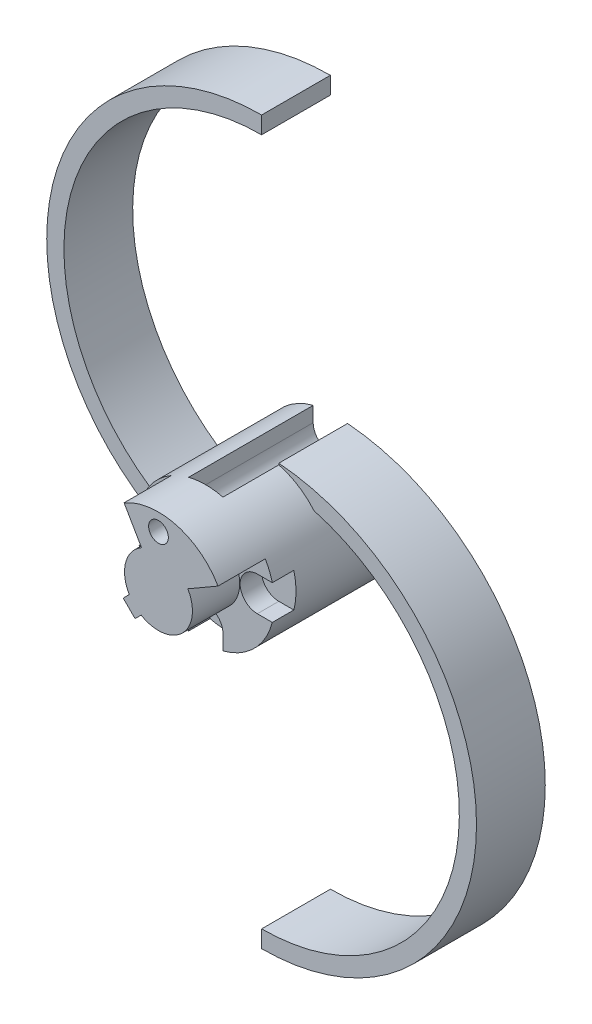
ISO-10303-21;
HEADER;
FILE_DESCRIPTION(('STEP AP214'),'2;1');
FILE_NAME('part.step','',(''),(''),'','','');
FILE_SCHEMA(('AUTOMOTIVE_DESIGN { 1 0 10303 214 1 1 1 1 }'));
ENDSEC;
DATA;
#1=APPLICATION_CONTEXT('core data for automotive mechanical design processes');
#2=APPLICATION_PROTOCOL_DEFINITION('international standard','automotive_design',2000,#1);
#3=PRODUCT_CONTEXT('',#1,'mechanical');
#4=PRODUCT('Part','Part','',(#3));
#5=PRODUCT_RELATED_PRODUCT_CATEGORY('part','',(#4));
#6=PRODUCT_DEFINITION_FORMATION('','',#4);
#7=PRODUCT_DEFINITION_CONTEXT('part definition',#1,'design');
#8=PRODUCT_DEFINITION('design','',#6,#7);
#9=PRODUCT_DEFINITION_SHAPE('','',#8);
#10=(LENGTH_UNIT() NAMED_UNIT(*) SI_UNIT(.MILLI.,.METRE.));
#11=(NAMED_UNIT(*) PLANE_ANGLE_UNIT() SI_UNIT($,.RADIAN.));
#12=(NAMED_UNIT(*) SI_UNIT($,.STERADIAN.) SOLID_ANGLE_UNIT());
#13=UNCERTAINTY_MEASURE_WITH_UNIT(LENGTH_MEASURE(1.E-05),#10,'distance_accuracy_value','');
#14=(GEOMETRIC_REPRESENTATION_CONTEXT(3) GLOBAL_UNCERTAINTY_ASSIGNED_CONTEXT((#13)) GLOBAL_UNIT_ASSIGNED_CONTEXT((#10,
#11,#12)) REPRESENTATION_CONTEXT('',''));
#15=CARTESIAN_POINT('',(0.,0.,0.));
#16=DIRECTION('',(0.,0.,1.));
#17=DIRECTION('',(1.,0.,0.));
#18=AXIS2_PLACEMENT_3D('',#15,#16,#17);
#19=CARTESIAN_POINT('',(-2.,-8.,17.6568542494924));
#20=DIRECTION('',(-1.,0.,0.));
#21=DIRECTION('',(0.,-1.,0.));
#22=AXIS2_PLACEMENT_3D('',#19,#20,#21);
#23=PLANE('',#22);
#24=DIRECTION('',(0.,0.,-1.));
#25=VECTOR('',#24,1.);
#26=CARTESIAN_POINT('',(-2.,-6.,17.6568542494924));
#27=LINE('',#26,#25);
#28=CARTESIAN_POINT('',(-2.,-6.,6.5));
#29=VERTEX_POINT('',#28);
#30=CARTESIAN_POINT('',(-2.,-6.,4.));
#31=VERTEX_POINT('',#30);
#32=EDGE_CURVE('E339',#29,#31,#27,.T.);
#33=ORIENTED_EDGE('',*,*,#32,.F.);
#34=DIRECTION('',(0.,-1.,0.));
#35=VECTOR('',#34,1.);
#36=CARTESIAN_POINT('',(-2.,-8.,6.5));
#37=LINE('',#36,#35);
#38=CARTESIAN_POINT('',(-2.,-7.74596669241483,6.5));
#39=VERTEX_POINT('',#38);
#40=EDGE_CURVE('E352',#29,#39,#37,.T.);
#41=ORIENTED_EDGE('',*,*,#40,.T.);
#42=DIRECTION('',(0.,0.,1.));
#43=VECTOR('',#42,1.);
#44=CARTESIAN_POINT('',(-2.,-7.74596669241483,-8.));
#45=LINE('',#44,#43);
#46=CARTESIAN_POINT('',(-2.,-7.74596669241483,4.));
#47=VERTEX_POINT('',#46);
#48=EDGE_CURVE('E466',#39,#47,#45,.F.);
#49=ORIENTED_EDGE('',*,*,#48,.T.);
#50=DIRECTION('',(0.,-1.,0.));
#51=VECTOR('',#50,1.);
#52=CARTESIAN_POINT('',(-2.,-8.,4.));
#53=LINE('',#52,#51);
#54=EDGE_CURVE('E837',#31,#47,#53,.T.);
#55=ORIENTED_EDGE('',*,*,#54,.F.);
#56=EDGE_LOOP('',(#33,#41,#49,#55));
#57=FACE_BOUND('',#56,.T.);
#58=ADVANCED_FACE('F35',(#57),#23,.F.);
#59=CARTESIAN_POINT('',(0.,0.,-8.));
#60=DIRECTION('',(0.,0.,1.));
#61=DIRECTION('',(-1.,0.,0.));
#62=AXIS2_PLACEMENT_3D('',#59,#60,#61);
#63=CYLINDRICAL_SURFACE('',#62,8.);
#64=CARTESIAN_POINT('',(0.,0.,4.));
#65=DIRECTION('',(0.,0.,-1.));
#66=DIRECTION('',(-1.,0.,0.));
#67=AXIS2_PLACEMENT_3D('',#64,#65,#66);
#68=CIRCLE('',#67,8.00000000000001);
#69=CARTESIAN_POINT('',(7.74596669241483,-2.,4.));
#70=VERTEX_POINT('',#69);
#71=CARTESIAN_POINT('',(7.74596669241483,2.,4.));
#72=VERTEX_POINT('',#71);
#73=EDGE_CURVE('E853',#70,#72,#68,.F.);
#74=ORIENTED_EDGE('',*,*,#73,.F.);
#75=DIRECTION('',(0.,0.,1.));
#76=VECTOR('',#75,1.);
#77=CARTESIAN_POINT('',(7.74596669241483,-2.,-8.));
#78=LINE('',#77,#76);
#79=CARTESIAN_POINT('',(7.74596669241483,-2.,6.5));
#80=VERTEX_POINT('',#79);
#81=EDGE_CURVE('E461',#80,#70,#78,.F.);
#82=ORIENTED_EDGE('',*,*,#81,.F.);
#83=CARTESIAN_POINT('',(0.,0.,6.5));
#84=DIRECTION('',(0.,0.,-1.));
#85=DIRECTION('',(-1.,0.,0.));
#86=AXIS2_PLACEMENT_3D('',#83,#84,#85);
#87=CIRCLE('',#86,8.);
#88=CARTESIAN_POINT('',(2.,-7.74596669241483,6.5));
#89=VERTEX_POINT('',#88);
#90=EDGE_CURVE('E886',#89,#80,#87,.F.);
#91=ORIENTED_EDGE('',*,*,#90,.F.);
#92=DIRECTION('',(0.,0.,1.));
#93=VECTOR('',#92,1.);
#94=CARTESIAN_POINT('',(2.,-7.74596669241483,-8.));
#95=LINE('',#94,#93);
#96=CARTESIAN_POINT('',(2.,-7.74596669241483,4.));
#97=VERTEX_POINT('',#96);
#98=EDGE_CURVE('E463',#97,#89,#95,.T.);
#99=ORIENTED_EDGE('',*,*,#98,.F.);
#100=EDGE_CURVE('E839',#47,#97,#68,.F.);
#101=ORIENTED_EDGE('',*,*,#100,.F.);
#102=ORIENTED_EDGE('',*,*,#48,.F.);
#103=CARTESIAN_POINT('',(-7.74596669241483,-2.,6.5));
#104=VERTEX_POINT('',#103);
#105=EDGE_CURVE('E850',#104,#39,#87,.F.);
#106=ORIENTED_EDGE('',*,*,#105,.F.);
#107=DIRECTION('',(0.,0.,1.));
#108=VECTOR('',#107,1.);
#109=CARTESIAN_POINT('',(-7.74596669241483,-2.,-8.));
#110=LINE('',#109,#108);
#111=CARTESIAN_POINT('',(-7.74596669241483,-2.,4.));
#112=VERTEX_POINT('',#111);
#113=EDGE_CURVE('E469',#112,#104,#110,.T.);
#114=ORIENTED_EDGE('',*,*,#113,.F.);
#115=CARTESIAN_POINT('',(-7.74596669241483,2.,4.));
#116=VERTEX_POINT('',#115);
#117=EDGE_CURVE('E852',#116,#112,#68,.F.);
#118=ORIENTED_EDGE('',*,*,#117,.F.);
#119=DIRECTION('',(0.,0.,1.));
#120=VECTOR('',#119,1.);
#121=CARTESIAN_POINT('',(-7.74596669241483,2.,-8.));
#122=LINE('',#121,#120);
#123=CARTESIAN_POINT('',(-7.74596669241483,2.,6.5));
#124=VERTEX_POINT('',#123);
#125=EDGE_CURVE('E472',#124,#116,#122,.F.);
#126=ORIENTED_EDGE('',*,*,#125,.F.);
#127=CARTESIAN_POINT('',(-4.00000000000001,6.92820323027551,6.5));
#128=VERTEX_POINT('',#127);
#129=EDGE_CURVE('E867',#128,#124,#87,.F.);
#130=ORIENTED_EDGE('',*,*,#129,.F.);
#131=DIRECTION('',(0.,0.,1.));
#132=VECTOR('',#131,1.);
#133=CARTESIAN_POINT('',(-4.00000000000001,6.92820323027551,-15.3826701223687));
#134=LINE('',#133,#132);
#135=CARTESIAN_POINT('',(-4.00000000000001,6.92820323027551,12.));
#136=VERTEX_POINT('',#135);
#137=EDGE_CURVE('E307',#128,#136,#134,.T.);
#138=ORIENTED_EDGE('',*,*,#137,.T.);
#139=CARTESIAN_POINT('',(0.,0.,12.));
#140=DIRECTION('',(0.,0.,-1.));
#141=DIRECTION('',(-1.,0.,0.));
#142=AXIS2_PLACEMENT_3D('',#139,#140,#141);
#143=CIRCLE('',#142,8.);
#144=CARTESIAN_POINT('',(6.92820323027549,4.00000000000003,12.));
#145=VERTEX_POINT('',#144);
#146=EDGE_CURVE('E394',#136,#145,#143,.T.);
#147=ORIENTED_EDGE('',*,*,#146,.T.);
#148=DIRECTION('',(0.,0.,1.));
#149=VECTOR('',#148,1.);
#150=CARTESIAN_POINT('',(6.92820323027549,4.00000000000003,-15.3826701223687));
#151=LINE('',#150,#149);
#152=CARTESIAN_POINT('',(6.92820323027549,4.00000000000003,6.5));
#153=VERTEX_POINT('',#152);
#154=EDGE_CURVE('E262',#153,#145,#151,.T.);
#155=ORIENTED_EDGE('',*,*,#154,.F.);
#156=CARTESIAN_POINT('',(7.74596669241483,2.,6.5));
#157=VERTEX_POINT('',#156);
#158=EDGE_CURVE('E298',#157,#153,#87,.F.);
#159=ORIENTED_EDGE('',*,*,#158,.F.);
#160=DIRECTION('',(0.,0.,1.));
#161=VECTOR('',#160,1.);
#162=CARTESIAN_POINT('',(7.74596669241483,2.,-8.));
#163=LINE('',#162,#161);
#164=EDGE_CURVE('E459',#72,#157,#163,.T.);
#165=ORIENTED_EDGE('',*,*,#164,.F.);
#166=EDGE_LOOP('',(#74,#82,#91,#99,#101,#102,#106,#114,#118,#126,#130,#138,#147,#155,#159,#165));
#167=FACE_BOUND('',#166,.T.);
#168=CARTESIAN_POINT('',(0.,0.,0.));
#169=DIRECTION('',(0.,0.,-1.));
#170=DIRECTION('',(-1.,0.,0.));
#171=AXIS2_PLACEMENT_3D('',#168,#169,#170);
#172=CIRCLE('',#171,8.);
#173=CARTESIAN_POINT('',(2.,7.74596669241483,0.));
#174=VERTEX_POINT('',#173);
#175=CARTESIAN_POINT('',(6.09952065732504,5.17647058823529,0.));
#176=VERTEX_POINT('',#175);
#177=EDGE_CURVE('E393',#174,#176,#172,.T.);
#178=ORIENTED_EDGE('',*,*,#177,.F.);
#179=DIRECTION('',(0.,0.,1.));
#180=VECTOR('',#179,1.);
#181=CARTESIAN_POINT('',(2.,7.74596669241483,-8.));
#182=LINE('',#181,#180);
#183=CARTESIAN_POINT('',(2.,7.74596669241483,6.5));
#184=VERTEX_POINT('',#183);
#185=EDGE_CURVE('E382',#184,#174,#182,.F.);
#186=ORIENTED_EDGE('',*,*,#185,.F.);
#187=CARTESIAN_POINT('',(0.,0.,6.5));
#188=DIRECTION('',(0.,0.,-1.));
#189=DIRECTION('',(-1.,0.,0.));
#190=AXIS2_PLACEMENT_3D('',#187,#188,#189);
#191=CIRCLE('',#190,8.);
#192=CARTESIAN_POINT('',(-2.,7.74596669241483,6.5));
#193=VERTEX_POINT('',#192);
#194=EDGE_CURVE('E376',#193,#184,#191,.T.);
#195=ORIENTED_EDGE('',*,*,#194,.F.);
#196=DIRECTION('',(0.,0.,1.));
#197=VECTOR('',#196,1.);
#198=CARTESIAN_POINT('',(-2.,7.74596669241483,-8.));
#199=LINE('',#198,#197);
#200=CARTESIAN_POINT('',(-2.,7.74596669241483,-8.));
#201=VERTEX_POINT('',#200);
#202=EDGE_CURVE('E43',#201,#193,#199,.T.);
#203=ORIENTED_EDGE('',*,*,#202,.F.);
#204=CARTESIAN_POINT('',(0.,0.,-8.));
#205=DIRECTION('',(0.,0.,1.));
#206=DIRECTION('',(1.,0.,0.));
#207=AXIS2_PLACEMENT_3D('',#204,#205,#206);
#208=CIRCLE('',#207,8.);
#209=CARTESIAN_POINT('',(-6.09952065732504,-5.17647058823529,-8.));
#210=VERTEX_POINT('',#209);
#211=EDGE_CURVE('E400',#201,#210,#208,.T.);
#212=ORIENTED_EDGE('',*,*,#211,.T.);
#213=DIRECTION('',(0.,0.,1.));
#214=VECTOR('',#213,1.);
#215=CARTESIAN_POINT('',(-6.09952065732504,-5.17647058823529,-8.));
#216=LINE('',#215,#214);
#217=CARTESIAN_POINT('',(-6.09952065732504,-5.17647058823529,0.));
#218=VERTEX_POINT('',#217);
#219=EDGE_CURVE('E452',#210,#218,#216,.T.);
#220=ORIENTED_EDGE('',*,*,#219,.T.);
#221=CARTESIAN_POINT('',(-2.,-7.74596669241483,0.));
#222=VERTEX_POINT('',#221);
#223=EDGE_CURVE('E399',#222,#218,#172,.T.);
#224=ORIENTED_EDGE('',*,*,#223,.F.);
#225=DIRECTION('',(0.,0.,-1.));
#226=VECTOR('',#225,1.);
#227=CARTESIAN_POINT('',(-2.,-7.74596669241485,27.5359137665061));
#228=LINE('',#227,#226);
#229=CARTESIAN_POINT('',(-2.,-7.74596669241485,-8.));
#230=VERTEX_POINT('',#229);
#231=EDGE_CURVE('E279',#222,#230,#228,.T.);
#232=ORIENTED_EDGE('',*,*,#231,.T.);
#233=CARTESIAN_POINT('',(0.,0.,-8.));
#234=DIRECTION('',(0.,0.,1.));
#235=DIRECTION('',(1.,0.,0.));
#236=AXIS2_PLACEMENT_3D('',#233,#234,#235);
#237=CIRCLE('',#236,8.);
#238=CARTESIAN_POINT('',(6.09952065732504,5.17647058823529,-8.));
#239=VERTEX_POINT('',#238);
#240=EDGE_CURVE('E413',#230,#239,#237,.T.);
#241=ORIENTED_EDGE('',*,*,#240,.T.);
#242=DIRECTION('',(0.,0.,1.));
#243=VECTOR('',#242,1.);
#244=CARTESIAN_POINT('',(6.09952065732504,5.17647058823529,-8.));
#245=LINE('',#244,#243);
#246=EDGE_CURVE('E445',#239,#176,#245,.T.);
#247=ORIENTED_EDGE('',*,*,#246,.T.);
#248=EDGE_LOOP('',(#178,#186,#195,#203,#212,#220,#224,#232,#241,#247));
#249=FACE_BOUND('',#248,.T.);
#250=ADVANCED_FACE('F483',(#167,#249),#63,.T.);
#251=CARTESIAN_POINT('',(0.,0.,0.));
#252=DIRECTION('',(0.,0.,-1.));
#253=DIRECTION('',(1.,0.,0.));
#254=AXIS2_PLACEMENT_3D('',#251,#252,#253);
#255=PLANE('',#254);
#256=ORIENTED_EDGE('',*,*,#177,.T.);
#257=CARTESIAN_POINT('',(0.,-17.,0.));
#258=DIRECTION('',(0.,0.,-1.));
#259=DIRECTION('',(-1.,0.,0.));
#260=AXIS2_PLACEMENT_3D('',#257,#258,#259);
#261=CIRCLE('',#260,23.);
#262=CARTESIAN_POINT('',(0.,-40.,0.));
#263=VERTEX_POINT('',#262);
#264=EDGE_CURVE('E434',#176,#263,#261,.T.);
#265=ORIENTED_EDGE('',*,*,#264,.T.);
#266=DIRECTION('',(0.,-1.,0.));
#267=VECTOR('',#266,1.);
#268=CARTESIAN_POINT('',(0.,-42.,0.));
#269=LINE('',#268,#267);
#270=CARTESIAN_POINT('',(0.,-42.,0.));
#271=VERTEX_POINT('',#270);
#272=EDGE_CURVE('E437',#263,#271,#269,.T.);
#273=ORIENTED_EDGE('',*,*,#272,.T.);
#274=CARTESIAN_POINT('',(0.,-17.,0.));
#275=DIRECTION('',(0.,0.,1.));
#276=DIRECTION('',(-1.,0.,0.));
#277=AXIS2_PLACEMENT_3D('',#274,#275,#276);
#278=CIRCLE('',#277,25.);
#279=CARTESIAN_POINT('',(2.,7.91987158875422,0.));
#280=VERTEX_POINT('',#279);
#281=EDGE_CURVE('E404',#271,#280,#278,.T.);
#282=ORIENTED_EDGE('',*,*,#281,.T.);
#283=DIRECTION('',(0.,1.,0.));
#284=VECTOR('',#283,1.);
#285=CARTESIAN_POINT('',(2.,0.,0.));
#286=LINE('',#285,#284);
#287=EDGE_CURVE('E379',#174,#280,#286,.T.);
#288=ORIENTED_EDGE('',*,*,#287,.F.);
#289=EDGE_LOOP('',(#256,#265,#273,#282,#288));
#290=FACE_BOUND('',#289,.T.);
#291=ADVANCED_FACE('F516',(#290),#255,.F.);
#292=ORIENTED_EDGE('',*,*,#223,.T.);
#293=CARTESIAN_POINT('',(0.,17.,0.));
#294=DIRECTION('',(0.,0.,-1.));
#295=DIRECTION('',(1.,0.,0.));
#296=AXIS2_PLACEMENT_3D('',#293,#294,#295);
#297=CIRCLE('',#296,23.);
#298=CARTESIAN_POINT('',(0.,40.,0.));
#299=VERTEX_POINT('',#298);
#300=EDGE_CURVE('E396',#218,#299,#297,.T.);
#301=ORIENTED_EDGE('',*,*,#300,.T.);
#302=DIRECTION('',(0.,1.,0.));
#303=VECTOR('',#302,1.);
#304=CARTESIAN_POINT('',(0.,42.,0.));
#305=LINE('',#304,#303);
#306=CARTESIAN_POINT('',(0.,42.,0.));
#307=VERTEX_POINT('',#306);
#308=EDGE_CURVE('E428',#299,#307,#305,.T.);
#309=ORIENTED_EDGE('',*,*,#308,.T.);
#310=CARTESIAN_POINT('',(0.,17.,0.));
#311=DIRECTION('',(0.,0.,1.));
#312=DIRECTION('',(-1.,0.,0.));
#313=AXIS2_PLACEMENT_3D('',#310,#311,#312);
#314=CIRCLE('',#313,25.);
#315=CARTESIAN_POINT('',(-2.,-7.91987158875422,0.));
#316=VERTEX_POINT('',#315);
#317=EDGE_CURVE('E431',#307,#316,#314,.T.);
#318=ORIENTED_EDGE('',*,*,#317,.T.);
#319=DIRECTION('',(0.,-1.,0.));
#320=VECTOR('',#319,1.);
#321=CARTESIAN_POINT('',(-2.,0.,0.));
#322=LINE('',#321,#320);
#323=EDGE_CURVE('E385',#222,#316,#322,.T.);
#324=ORIENTED_EDGE('',*,*,#323,.F.);
#325=EDGE_LOOP('',(#292,#301,#309,#318,#324));
#326=FACE_BOUND('',#325,.T.);
#327=ADVANCED_FACE('F503',(#326),#255,.F.);
#328=CARTESIAN_POINT('',(0.,0.,-8.));
#329=DIRECTION('',(0.,0.,-1.));
#330=DIRECTION('',(1.,0.,0.));
#331=AXIS2_PLACEMENT_3D('',#328,#329,#330);
#332=PLANE('',#331);
#333=ORIENTED_EDGE('',*,*,#240,.F.);
#334=DIRECTION('',(0.,-1.,0.));
#335=VECTOR('',#334,1.);
#336=CARTESIAN_POINT('',(-2.,-8.,-8.));
#337=LINE('',#336,#335);
#338=CARTESIAN_POINT('',(-2.,-7.91987158875422,-8.));
#339=VERTEX_POINT('',#338);
#340=EDGE_CURVE('E349',#230,#339,#337,.T.);
#341=ORIENTED_EDGE('',*,*,#340,.T.);
#342=CARTESIAN_POINT('',(0.,17.,-8.));
#343=DIRECTION('',(0.,0.,1.));
#344=DIRECTION('',(-1.,0.,0.));
#345=AXIS2_PLACEMENT_3D('',#342,#343,#344);
#346=CIRCLE('',#345,25.);
#347=CARTESIAN_POINT('',(0.,42.,-8.));
#348=VERTEX_POINT('',#347);
#349=EDGE_CURVE('E410',#348,#339,#346,.T.);
#350=ORIENTED_EDGE('',*,*,#349,.F.);
#351=DIRECTION('',(0.,1.,0.));
#352=VECTOR('',#351,1.);
#353=CARTESIAN_POINT('',(0.,42.,-8.));
#354=LINE('',#353,#352);
#355=CARTESIAN_POINT('',(0.,40.,-8.));
#356=VERTEX_POINT('',#355);
#357=EDGE_CURVE('E407',#356,#348,#354,.T.);
#358=ORIENTED_EDGE('',*,*,#357,.F.);
#359=CARTESIAN_POINT('',(0.,17.,-8.));
#360=DIRECTION('',(0.,0.,-1.));
#361=DIRECTION('',(1.,0.,0.));
#362=AXIS2_PLACEMENT_3D('',#359,#360,#361);
#363=CIRCLE('',#362,23.);
#364=EDGE_CURVE('E403',#210,#356,#363,.T.);
#365=ORIENTED_EDGE('',*,*,#364,.F.);
#366=ORIENTED_EDGE('',*,*,#211,.F.);
#367=DIRECTION('',(0.,-1.,0.));
#368=VECTOR('',#367,1.);
#369=CARTESIAN_POINT('',(-2.,6.,-8.));
#370=LINE('',#369,#368);
#371=CARTESIAN_POINT('',(-2.,6.,-8.));
#372=VERTEX_POINT('',#371);
#373=EDGE_CURVE('E314',#201,#372,#370,.T.);
#374=ORIENTED_EDGE('',*,*,#373,.T.);
#375=CARTESIAN_POINT('',(0.,6.,-8.));
#376=DIRECTION('',(0.,0.,1.));
#377=DIRECTION('',(-1.,0.,0.));
#378=AXIS2_PLACEMENT_3D('',#375,#376,#377);
#379=CIRCLE('',#378,2.);
#380=CARTESIAN_POINT('',(2.,6.,-8.));
#381=VERTEX_POINT('',#380);
#382=EDGE_CURVE('E321',#372,#381,#379,.T.);
#383=ORIENTED_EDGE('',*,*,#382,.T.);
#384=DIRECTION('',(0.,1.,0.));
#385=VECTOR('',#384,1.);
#386=CARTESIAN_POINT('',(2.,8.,-8.));
#387=LINE('',#386,#385);
#388=CARTESIAN_POINT('',(2.,7.91987158875422,-8.));
#389=VERTEX_POINT('',#388);
#390=EDGE_CURVE('E318',#381,#389,#387,.T.);
#391=ORIENTED_EDGE('',*,*,#390,.T.);
#392=CARTESIAN_POINT('',(0.,-17.,-8.));
#393=DIRECTION('',(0.,0.,1.));
#394=DIRECTION('',(-1.,0.,0.));
#395=AXIS2_PLACEMENT_3D('',#392,#393,#394);
#396=CIRCLE('',#395,25.);
#397=CARTESIAN_POINT('',(0.,-42.,-8.));
#398=VERTEX_POINT('',#397);
#399=EDGE_CURVE('E422',#398,#389,#396,.T.);
#400=ORIENTED_EDGE('',*,*,#399,.F.);
#401=DIRECTION('',(0.,-1.,0.));
#402=VECTOR('',#401,1.);
#403=CARTESIAN_POINT('',(0.,-42.,-8.));
#404=LINE('',#403,#402);
#405=CARTESIAN_POINT('',(0.,-40.,-8.));
#406=VERTEX_POINT('',#405);
#407=EDGE_CURVE('E419',#406,#398,#404,.T.);
#408=ORIENTED_EDGE('',*,*,#407,.F.);
#409=CARTESIAN_POINT('',(0.,-17.,-8.));
#410=DIRECTION('',(0.,0.,-1.));
#411=DIRECTION('',(-1.,0.,0.));
#412=AXIS2_PLACEMENT_3D('',#409,#410,#411);
#413=CIRCLE('',#412,23.);
#414=EDGE_CURVE('E416',#239,#406,#413,.T.);
#415=ORIENTED_EDGE('',*,*,#414,.F.);
#416=EDGE_LOOP('',(#333,#341,#350,#358,#365,#366,#374,#383,#391,#400,#408,#415));
#417=FACE_BOUND('',#416,.T.);
#418=ADVANCED_FACE('F495',(#417),#332,.T.);
#419=CARTESIAN_POINT('',(0.,17.,-8.));
#420=DIRECTION('',(0.,0.,1.));
#421=DIRECTION('',(-1.,0.,0.));
#422=AXIS2_PLACEMENT_3D('',#419,#420,#421);
#423=CYLINDRICAL_SURFACE('',#422,23.);
#424=ORIENTED_EDGE('',*,*,#300,.F.);
#425=ORIENTED_EDGE('',*,*,#219,.F.);
#426=ORIENTED_EDGE('',*,*,#364,.T.);
#427=DIRECTION('',(0.,0.,1.));
#428=VECTOR('',#427,1.);
#429=CARTESIAN_POINT('',(0.,40.,-8.));
#430=LINE('',#429,#428);
#431=EDGE_CURVE('E450',#356,#299,#430,.T.);
#432=ORIENTED_EDGE('',*,*,#431,.T.);
#433=EDGE_LOOP('',(#424,#425,#426,#432));
#434=FACE_BOUND('',#433,.T.);
#435=ADVANCED_FACE('F37',(#434),#423,.F.);
#436=CARTESIAN_POINT('',(0.,42.,-8.));
#437=DIRECTION('',(-1.,0.,0.));
#438=DIRECTION('',(0.,0.,-1.));
#439=AXIS2_PLACEMENT_3D('',#436,#437,#438);
#440=PLANE('',#439);
#441=ORIENTED_EDGE('',*,*,#308,.F.);
#442=ORIENTED_EDGE('',*,*,#431,.F.);
#443=ORIENTED_EDGE('',*,*,#357,.T.);
#444=DIRECTION('',(0.,0.,1.));
#445=VECTOR('',#444,1.);
#446=CARTESIAN_POINT('',(0.,42.,-8.));
#447=LINE('',#446,#445);
#448=EDGE_CURVE('E448',#348,#307,#447,.T.);
#449=ORIENTED_EDGE('',*,*,#448,.T.);
#450=EDGE_LOOP('',(#441,#442,#443,#449));
#451=FACE_BOUND('',#450,.T.);
#452=ADVANCED_FACE('F589',(#451),#440,.F.);
#453=CARTESIAN_POINT('',(0.,17.,-8.));
#454=DIRECTION('',(0.,0.,1.));
#455=DIRECTION('',(-1.,0.,0.));
#456=AXIS2_PLACEMENT_3D('',#453,#454,#455);
#457=CYLINDRICAL_SURFACE('',#456,25.);
#458=ORIENTED_EDGE('',*,*,#317,.F.);
#459=ORIENTED_EDGE('',*,*,#448,.F.);
#460=ORIENTED_EDGE('',*,*,#349,.T.);
#461=DIRECTION('',(0.,0.,1.));
#462=VECTOR('',#461,1.);
#463=CARTESIAN_POINT('',(-2.,-7.91987158875422,-8.));
#464=LINE('',#463,#462);
#465=EDGE_CURVE('E388',#316,#339,#464,.F.);
#466=ORIENTED_EDGE('',*,*,#465,.F.);
#467=EDGE_LOOP('',(#458,#459,#460,#466));
#468=FACE_BOUND('',#467,.T.);
#469=ADVANCED_FACE('F532',(#468),#457,.T.);
#470=CARTESIAN_POINT('',(0.,-17.,-8.));
#471=DIRECTION('',(0.,0.,1.));
#472=DIRECTION('',(-1.,0.,0.));
#473=AXIS2_PLACEMENT_3D('',#470,#471,#472);
#474=CYLINDRICAL_SURFACE('',#473,23.);
#475=ORIENTED_EDGE('',*,*,#264,.F.);
#476=ORIENTED_EDGE('',*,*,#246,.F.);
#477=ORIENTED_EDGE('',*,*,#414,.T.);
#478=DIRECTION('',(0.,0.,1.));
#479=VECTOR('',#478,1.);
#480=CARTESIAN_POINT('',(0.,-40.,-8.));
#481=LINE('',#480,#479);
#482=EDGE_CURVE('E443',#406,#263,#481,.T.);
#483=ORIENTED_EDGE('',*,*,#482,.T.);
#484=EDGE_LOOP('',(#475,#476,#477,#483));
#485=FACE_BOUND('',#484,.T.);
#486=ADVANCED_FACE('F513',(#485),#474,.F.);
#487=CARTESIAN_POINT('',(0.,-42.,-8.));
#488=DIRECTION('',(1.,0.,0.));
#489=DIRECTION('',(0.,0.,1.));
#490=AXIS2_PLACEMENT_3D('',#487,#488,#489);
#491=PLANE('',#490);
#492=ORIENTED_EDGE('',*,*,#272,.F.);
#493=ORIENTED_EDGE('',*,*,#482,.F.);
#494=ORIENTED_EDGE('',*,*,#407,.T.);
#495=DIRECTION('',(0.,0.,1.));
#496=VECTOR('',#495,1.);
#497=CARTESIAN_POINT('',(0.,-42.,-8.));
#498=LINE('',#497,#496);
#499=EDGE_CURVE('E425',#398,#271,#498,.T.);
#500=ORIENTED_EDGE('',*,*,#499,.T.);
#501=EDGE_LOOP('',(#492,#493,#494,#500));
#502=FACE_BOUND('',#501,.T.);
#503=ADVANCED_FACE('F523',(#502),#491,.F.);
#504=CARTESIAN_POINT('',(0.,-17.,-8.));
#505=DIRECTION('',(0.,0.,1.));
#506=DIRECTION('',(-1.,0.,0.));
#507=AXIS2_PLACEMENT_3D('',#504,#505,#506);
#508=CYLINDRICAL_SURFACE('',#507,25.);
#509=ORIENTED_EDGE('',*,*,#281,.F.);
#510=ORIENTED_EDGE('',*,*,#499,.F.);
#511=ORIENTED_EDGE('',*,*,#399,.T.);
#512=DIRECTION('',(0.,0.,1.));
#513=VECTOR('',#512,1.);
#514=CARTESIAN_POINT('',(2.,7.91987158875422,-8.));
#515=LINE('',#514,#513);
#516=EDGE_CURVE('E457',#280,#389,#515,.F.);
#517=ORIENTED_EDGE('',*,*,#516,.F.);
#518=EDGE_LOOP('',(#509,#510,#511,#517));
#519=FACE_BOUND('',#518,.T.);
#520=ADVANCED_FACE('F521',(#519),#508,.T.);
#521=CARTESIAN_POINT('',(0.,6.,-8.));
#522=DIRECTION('',(0.,0.,1.));
#523=DIRECTION('',(-1.,0.,0.));
#524=AXIS2_PLACEMENT_3D('',#521,#522,#523);
#525=CYLINDRICAL_SURFACE('',#524,1.15);
#526=CARTESIAN_POINT('',(0.,6.,6.5));
#527=DIRECTION('',(0.,0.,-1.));
#528=DIRECTION('',(-1.,0.,0.));
#529=AXIS2_PLACEMENT_3D('',#526,#527,#528);
#530=CIRCLE('',#529,1.15);
#531=CARTESIAN_POINT('',(-1.15,6.,6.5));
#532=VERTEX_POINT('',#531);
#533=EDGE_CURVE('E335',#532,#532,#530,.T.);
#534=ORIENTED_EDGE('',*,*,#533,.T.);
#535=EDGE_LOOP('',(#534));
#536=FACE_BOUND('',#535,.T.);
#537=CARTESIAN_POINT('',(0.,6.,12.));
#538=DIRECTION('',(0.,0.,-1.));
#539=DIRECTION('',(-1.,0.,0.));
#540=AXIS2_PLACEMENT_3D('',#537,#538,#539);
#541=CIRCLE('',#540,1.15);
#542=CARTESIAN_POINT('',(-1.15,6.,12.));
#543=VERTEX_POINT('',#542);
#544=EDGE_CURVE('E390',#543,#543,#541,.T.);
#545=ORIENTED_EDGE('',*,*,#544,.F.);
#546=EDGE_LOOP('',(#545));
#547=FACE_BOUND('',#546,.T.);
#548=ADVANCED_FACE('F530',(#536,#547),#525,.F.);
#549=CARTESIAN_POINT('',(0.,0.,12.));
#550=DIRECTION('',(0.,0.,1.));
#551=DIRECTION('',(-1.,0.,0.));
#552=AXIS2_PLACEMENT_3D('',#549,#550,#551);
#553=PLANE('',#552);
#554=DIRECTION('',(0.500000000000001,-0.866025403784438,0.));
#555=VECTOR('',#554,1.);
#556=CARTESIAN_POINT('',(-4.00000000000001,6.92820323027551,12.));
#557=LINE('',#556,#555);
#558=CARTESIAN_POINT('',(-1.975,3.42080034494853,12.));
#559=VERTEX_POINT('',#558);
#560=EDGE_CURVE('E272',#136,#559,#557,.T.);
#561=ORIENTED_EDGE('',*,*,#560,.T.);
#562=CARTESIAN_POINT('',(0.,0.,12.));
#563=DIRECTION('',(0.,0.,1.));
#564=DIRECTION('',(-1.,0.,0.));
#565=AXIS2_PLACEMENT_3D('',#562,#563,#564);
#566=CIRCLE('',#565,3.95);
#567=CARTESIAN_POINT('',(-3.39607602250434,-2.01721779919054,12.));
#568=VERTEX_POINT('',#567);
#569=EDGE_CURVE('E287',#559,#568,#566,.T.);
#570=ORIENTED_EDGE('',*,*,#569,.T.);
#571=DIRECTION('',(-0.707106781186552,-0.707106781186543,0.));
#572=VECTOR('',#571,1.);
#573=CARTESIAN_POINT('',(-4.10318280369089,-2.72432458037708,12.));
#574=LINE('',#573,#572);
#575=CARTESIAN_POINT('',(-4.10318280369089,-2.72432458037708,12.));
#576=VERTEX_POINT('',#575);
#577=EDGE_CURVE('E290',#568,#576,#574,.T.);
#578=ORIENTED_EDGE('',*,*,#577,.T.);
#579=DIRECTION('',(0.707106781186544,-0.707106781186551,0.));
#580=VECTOR('',#579,1.);
#581=CARTESIAN_POINT('',(-2.72432458037713,-4.10318280369086,12.));
#582=LINE('',#581,#580);
#583=CARTESIAN_POINT('',(-2.72432458037713,-4.10318280369086,12.));
#584=VERTEX_POINT('',#583);
#585=EDGE_CURVE('E293',#576,#584,#582,.T.);
#586=ORIENTED_EDGE('',*,*,#585,.T.);
#587=DIRECTION('',(0.707106781186552,0.707106781186543,0.));
#588=VECTOR('',#587,1.);
#589=CARTESIAN_POINT('',(-2.01721779919058,-3.39607602250432,12.));
#590=LINE('',#589,#588);
#591=CARTESIAN_POINT('',(-2.01721779919058,-3.39607602250432,12.));
#592=VERTEX_POINT('',#591);
#593=EDGE_CURVE('E263',#584,#592,#590,.T.);
#594=ORIENTED_EDGE('',*,*,#593,.T.);
#595=CARTESIAN_POINT('',(0.,0.,12.));
#596=DIRECTION('',(0.,0.,1.));
#597=DIRECTION('',(-1.,0.,0.));
#598=AXIS2_PLACEMENT_3D('',#595,#596,#597);
#599=CIRCLE('',#598,3.95);
#600=CARTESIAN_POINT('',(3.42080034494852,1.97500000000002,12.));
#601=VERTEX_POINT('',#600);
#602=EDGE_CURVE('E256',#592,#601,#599,.T.);
#603=ORIENTED_EDGE('',*,*,#602,.T.);
#604=DIRECTION('',(0.866025403784436,0.500000000000004,0.));
#605=VECTOR('',#604,1.);
#606=CARTESIAN_POINT('',(3.42080034494852,1.97500000000002,12.));
#607=LINE('',#606,#605);
#608=EDGE_CURVE('E266',#601,#145,#607,.T.);
#609=ORIENTED_EDGE('',*,*,#608,.T.);
#610=ORIENTED_EDGE('',*,*,#146,.F.);
#611=EDGE_LOOP('',(#561,#570,#578,#586,#594,#603,#609,#610));
#612=FACE_BOUND('',#611,.T.);
#613=ORIENTED_EDGE('',*,*,#544,.T.);
#614=EDGE_LOOP('',(#613));
#615=FACE_BOUND('',#614,.T.);
#616=ADVANCED_FACE('F275',(#612,#615),#553,.T.);
#617=CARTESIAN_POINT('',(8.,-2.,17.6568542494924));
#618=DIRECTION('',(0.,-1.,0.));
#619=DIRECTION('',(1.,0.,0.));
#620=AXIS2_PLACEMENT_3D('',#617,#618,#619);
#621=PLANE('',#620);
#622=DIRECTION('',(0.,0.,-1.));
#623=VECTOR('',#622,1.);
#624=CARTESIAN_POINT('',(6.,-2.,17.6568542494924));
#625=LINE('',#624,#623);
#626=CARTESIAN_POINT('',(6.,-2.,6.5));
#627=VERTEX_POINT('',#626);
#628=CARTESIAN_POINT('',(6.,-2.,4.));
#629=VERTEX_POINT('',#628);
#630=EDGE_CURVE('E353',#627,#629,#625,.T.);
#631=ORIENTED_EDGE('',*,*,#630,.F.);
#632=DIRECTION('',(1.,0.,0.));
#633=VECTOR('',#632,1.);
#634=CARTESIAN_POINT('',(8.,-2.,6.5));
#635=LINE('',#634,#633);
#636=EDGE_CURVE('E313',#627,#80,#635,.T.);
#637=ORIENTED_EDGE('',*,*,#636,.T.);
#638=ORIENTED_EDGE('',*,*,#81,.T.);
#639=DIRECTION('',(1.,0.,0.));
#640=VECTOR('',#639,1.);
#641=CARTESIAN_POINT('',(8.,-2.,4.));
#642=LINE('',#641,#640);
#643=EDGE_CURVE('E50',#629,#70,#642,.T.);
#644=ORIENTED_EDGE('',*,*,#643,.F.);
#645=EDGE_LOOP('',(#631,#637,#638,#644));
#646=FACE_BOUND('',#645,.T.);
#647=ADVANCED_FACE('F559',(#646),#621,.F.);
#648=CARTESIAN_POINT('',(6.,2.,17.6568542494924));
#649=DIRECTION('',(0.,1.,0.));
#650=DIRECTION('',(-1.,0.,0.));
#651=AXIS2_PLACEMENT_3D('',#648,#649,#650);
#652=PLANE('',#651);
#653=ORIENTED_EDGE('',*,*,#164,.T.);
#654=DIRECTION('',(-1.,0.,0.));
#655=VECTOR('',#654,1.);
#656=CARTESIAN_POINT('',(6.,2.,6.5));
#657=LINE('',#656,#655);
#658=CARTESIAN_POINT('',(6.,2.,6.5));
#659=VERTEX_POINT('',#658);
#660=EDGE_CURVE('E367',#157,#659,#657,.T.);
#661=ORIENTED_EDGE('',*,*,#660,.T.);
#662=DIRECTION('',(0.,0.,-1.));
#663=VECTOR('',#662,1.);
#664=CARTESIAN_POINT('',(6.,2.,17.6568542494924));
#665=LINE('',#664,#663);
#666=CARTESIAN_POINT('',(6.,2.,4.));
#667=VERTEX_POINT('',#666);
#668=EDGE_CURVE('E370',#659,#667,#665,.T.);
#669=ORIENTED_EDGE('',*,*,#668,.T.);
#670=DIRECTION('',(-1.,0.,0.));
#671=VECTOR('',#670,1.);
#672=CARTESIAN_POINT('',(6.,2.,4.));
#673=LINE('',#672,#671);
#674=EDGE_CURVE('E58',#72,#667,#673,.T.);
#675=ORIENTED_EDGE('',*,*,#674,.F.);
#676=EDGE_LOOP('',(#653,#661,#669,#675));
#677=FACE_BOUND('',#676,.T.);
#678=ADVANCED_FACE('F554',(#677),#652,.F.);
#679=CARTESIAN_POINT('',(6.,0.,17.6568542494924));
#680=DIRECTION('',(0.,0.,-1.));
#681=DIRECTION('',(1.,0.,0.));
#682=AXIS2_PLACEMENT_3D('',#679,#680,#681);
#683=CYLINDRICAL_SURFACE('',#682,2.);
#684=ORIENTED_EDGE('',*,*,#668,.F.);
#685=CARTESIAN_POINT('',(6.,0.,6.5));
#686=DIRECTION('',(0.,0.,-1.));
#687=DIRECTION('',(-1.,0.,0.));
#688=AXIS2_PLACEMENT_3D('',#685,#686,#687);
#689=CIRCLE('',#688,2.);
#690=EDGE_CURVE('E368',#659,#627,#689,.F.);
#691=ORIENTED_EDGE('',*,*,#690,.T.);
#692=ORIENTED_EDGE('',*,*,#630,.T.);
#693=CARTESIAN_POINT('',(6.,0.,4.));
#694=DIRECTION('',(0.,0.,-1.));
#695=DIRECTION('',(-1.,0.,0.));
#696=AXIS2_PLACEMENT_3D('',#693,#694,#695);
#697=CIRCLE('',#696,2.);
#698=EDGE_CURVE('E842',#667,#629,#697,.F.);
#699=ORIENTED_EDGE('',*,*,#698,.F.);
#700=EDGE_LOOP('',(#684,#691,#692,#699));
#701=FACE_BOUND('',#700,.T.);
#702=ADVANCED_FACE('F547',(#701),#683,.F.);
#703=ORIENTED_EDGE('',*,*,#323,.T.);
#704=ORIENTED_EDGE('',*,*,#465,.T.);
#705=ORIENTED_EDGE('',*,*,#340,.F.);
#706=ORIENTED_EDGE('',*,*,#231,.F.);
#707=EDGE_LOOP('',(#703,#704,#705,#706));
#708=FACE_BOUND('',#707,.T.);
#709=ADVANCED_FACE('F507',(#708),#23,.F.);
#710=CARTESIAN_POINT('',(2.,-6.,17.6568542494924));
#711=DIRECTION('',(1.,0.,0.));
#712=DIRECTION('',(0.,1.,0.));
#713=AXIS2_PLACEMENT_3D('',#710,#711,#712);
#714=PLANE('',#713);
#715=ORIENTED_EDGE('',*,*,#98,.T.);
#716=DIRECTION('',(0.,1.,0.));
#717=VECTOR('',#716,1.);
#718=CARTESIAN_POINT('',(2.,-6.,6.5));
#719=LINE('',#718,#717);
#720=CARTESIAN_POINT('',(2.,-6.,6.5));
#721=VERTEX_POINT('',#720);
#722=EDGE_CURVE('E356',#89,#721,#719,.T.);
#723=ORIENTED_EDGE('',*,*,#722,.T.);
#724=DIRECTION('',(0.,0.,-1.));
#725=VECTOR('',#724,1.);
#726=CARTESIAN_POINT('',(2.,-6.,17.6568542494924));
#727=LINE('',#726,#725);
#728=CARTESIAN_POINT('',(2.,-6.,4.));
#729=VERTEX_POINT('',#728);
#730=EDGE_CURVE('E359',#721,#729,#727,.T.);
#731=ORIENTED_EDGE('',*,*,#730,.T.);
#732=DIRECTION('',(0.,1.,0.));
#733=VECTOR('',#732,1.);
#734=CARTESIAN_POINT('',(2.,-6.,4.));
#735=LINE('',#734,#733);
#736=EDGE_CURVE('E843',#97,#729,#735,.T.);
#737=ORIENTED_EDGE('',*,*,#736,.F.);
#738=EDGE_LOOP('',(#715,#723,#731,#737));
#739=FACE_BOUND('',#738,.T.);
#740=ADVANCED_FACE('F546',(#739),#714,.F.);
#741=CARTESIAN_POINT('',(0.,-6.,17.6568542494924));
#742=DIRECTION('',(0.,0.,-1.));
#743=DIRECTION('',(1.,0.,0.));
#744=AXIS2_PLACEMENT_3D('',#741,#742,#743);
#745=CYLINDRICAL_SURFACE('',#744,2.);
#746=ORIENTED_EDGE('',*,*,#730,.F.);
#747=CARTESIAN_POINT('',(0.,-6.,6.5));
#748=DIRECTION('',(0.,0.,-1.));
#749=DIRECTION('',(-1.,0.,0.));
#750=AXIS2_PLACEMENT_3D('',#747,#748,#749);
#751=CIRCLE('',#750,2.);
#752=EDGE_CURVE('E357',#721,#29,#751,.F.);
#753=ORIENTED_EDGE('',*,*,#752,.T.);
#754=ORIENTED_EDGE('',*,*,#32,.T.);
#755=CARTESIAN_POINT('',(0.,-6.,4.));
#756=DIRECTION('',(0.,0.,-1.));
#757=DIRECTION('',(-1.,0.,0.));
#758=AXIS2_PLACEMENT_3D('',#755,#756,#757);
#759=CIRCLE('',#758,2.);
#760=EDGE_CURVE('E841',#729,#31,#759,.F.);
#761=ORIENTED_EDGE('',*,*,#760,.F.);
#762=EDGE_LOOP('',(#746,#753,#754,#761));
#763=FACE_BOUND('',#762,.T.);
#764=ADVANCED_FACE('F552',(#763),#745,.F.);
#765=CARTESIAN_POINT('',(-8.,2.,17.6568542494924));
#766=DIRECTION('',(0.,1.,0.));
#767=DIRECTION('',(0.,0.,-1.));
#768=AXIS2_PLACEMENT_3D('',#765,#766,#767);
#769=PLANE('',#768);
#770=DIRECTION('',(0.,0.,-1.));
#771=VECTOR('',#770,1.);
#772=CARTESIAN_POINT('',(-6.,2.,17.6568542494924));
#773=LINE('',#772,#771);
#774=CARTESIAN_POINT('',(-6.,2.,6.5));
#775=VERTEX_POINT('',#774);
#776=CARTESIAN_POINT('',(-6.,2.,4.));
#777=VERTEX_POINT('',#776);
#778=EDGE_CURVE('E324',#775,#777,#773,.T.);
#779=ORIENTED_EDGE('',*,*,#778,.F.);
#780=DIRECTION('',(-1.,0.,0.));
#781=VECTOR('',#780,1.);
#782=CARTESIAN_POINT('',(-8.,2.,6.5));
#783=LINE('',#782,#781);
#784=EDGE_CURVE('E336',#775,#124,#783,.T.);
#785=ORIENTED_EDGE('',*,*,#784,.T.);
#786=ORIENTED_EDGE('',*,*,#125,.T.);
#787=DIRECTION('',(-1.,0.,0.));
#788=VECTOR('',#787,1.);
#789=CARTESIAN_POINT('',(-8.,2.,4.));
#790=LINE('',#789,#788);
#791=EDGE_CURVE('E860',#777,#116,#790,.T.);
#792=ORIENTED_EDGE('',*,*,#791,.F.);
#793=EDGE_LOOP('',(#779,#785,#786,#792));
#794=FACE_BOUND('',#793,.T.);
#795=ADVANCED_FACE('F664',(#794),#769,.F.);
#796=CARTESIAN_POINT('',(-6.,-2.,17.6568542494924));
#797=DIRECTION('',(0.,-1.,0.));
#798=DIRECTION('',(0.,0.,1.));
#799=AXIS2_PLACEMENT_3D('',#796,#797,#798);
#800=PLANE('',#799);
#801=ORIENTED_EDGE('',*,*,#113,.T.);
#802=DIRECTION('',(1.,0.,0.));
#803=VECTOR('',#802,1.);
#804=CARTESIAN_POINT('',(-6.,-2.,6.5));
#805=LINE('',#804,#803);
#806=CARTESIAN_POINT('',(-6.,-2.,6.5));
#807=VERTEX_POINT('',#806);
#808=EDGE_CURVE('E338',#104,#807,#805,.T.);
#809=ORIENTED_EDGE('',*,*,#808,.T.);
#810=DIRECTION('',(0.,0.,-1.));
#811=VECTOR('',#810,1.);
#812=CARTESIAN_POINT('',(-6.,-2.,17.6568542494924));
#813=LINE('',#812,#811);
#814=CARTESIAN_POINT('',(-6.,-2.,4.));
#815=VERTEX_POINT('',#814);
#816=EDGE_CURVE('E342',#807,#815,#813,.T.);
#817=ORIENTED_EDGE('',*,*,#816,.T.);
#818=DIRECTION('',(1.,0.,0.));
#819=VECTOR('',#818,1.);
#820=CARTESIAN_POINT('',(-6.,-2.,4.));
#821=LINE('',#820,#819);
#822=EDGE_CURVE('E856',#112,#815,#821,.T.);
#823=ORIENTED_EDGE('',*,*,#822,.F.);
#824=EDGE_LOOP('',(#801,#809,#817,#823));
#825=FACE_BOUND('',#824,.T.);
#826=ADVANCED_FACE('F674',(#825),#800,.F.);
#827=CARTESIAN_POINT('',(-6.,0.,17.6568542494924));
#828=DIRECTION('',(0.,0.,-1.));
#829=DIRECTION('',(1.,0.,0.));
#830=AXIS2_PLACEMENT_3D('',#827,#828,#829);
#831=CYLINDRICAL_SURFACE('',#830,2.);
#832=ORIENTED_EDGE('',*,*,#816,.F.);
#833=CARTESIAN_POINT('',(-6.,0.,6.5));
#834=DIRECTION('',(0.,0.,-1.));
#835=DIRECTION('',(-1.,0.,0.));
#836=AXIS2_PLACEMENT_3D('',#833,#834,#835);
#837=CIRCLE('',#836,2.);
#838=EDGE_CURVE('E340',#807,#775,#837,.F.);
#839=ORIENTED_EDGE('',*,*,#838,.T.);
#840=ORIENTED_EDGE('',*,*,#778,.T.);
#841=CARTESIAN_POINT('',(-6.,0.,4.));
#842=DIRECTION('',(0.,0.,-1.));
#843=DIRECTION('',(-1.,0.,0.));
#844=AXIS2_PLACEMENT_3D('',#841,#842,#843);
#845=CIRCLE('',#844,2.);
#846=EDGE_CURVE('E12',#815,#777,#845,.F.);
#847=ORIENTED_EDGE('',*,*,#846,.F.);
#848=EDGE_LOOP('',(#832,#839,#840,#847));
#849=FACE_BOUND('',#848,.T.);
#850=ADVANCED_FACE('F684',(#849),#831,.F.);
#851=CARTESIAN_POINT('',(-2.,6.,17.6568542494924));
#852=DIRECTION('',(-1.,0.,0.));
#853=DIRECTION('',(0.,-1.,0.));
#854=AXIS2_PLACEMENT_3D('',#851,#852,#853);
#855=PLANE('',#854);
#856=ORIENTED_EDGE('',*,*,#373,.F.);
#857=ORIENTED_EDGE('',*,*,#202,.T.);
#858=DIRECTION('',(0.,-1.,0.));
#859=VECTOR('',#858,1.);
#860=CARTESIAN_POINT('',(-2.,6.,6.5));
#861=LINE('',#860,#859);
#862=CARTESIAN_POINT('',(-2.,6.,6.5));
#863=VERTEX_POINT('',#862);
#864=EDGE_CURVE('E326',#193,#863,#861,.T.);
#865=ORIENTED_EDGE('',*,*,#864,.T.);
#866=DIRECTION('',(0.,0.,-1.));
#867=VECTOR('',#866,1.);
#868=CARTESIAN_POINT('',(-2.,6.,17.6568542494924));
#869=LINE('',#868,#867);
#870=EDGE_CURVE('E330',#863,#372,#869,.T.);
#871=ORIENTED_EDGE('',*,*,#870,.T.);
#872=EDGE_LOOP('',(#856,#857,#865,#871));
#873=FACE_BOUND('',#872,.T.);
#874=ADVANCED_FACE('F478',(#873),#855,.F.);
#875=CARTESIAN_POINT('',(2.,8.,17.6568542494924));
#876=DIRECTION('',(1.,0.,0.));
#877=DIRECTION('',(0.,1.,0.));
#878=AXIS2_PLACEMENT_3D('',#875,#876,#877);
#879=PLANE('',#878);
#880=DIRECTION('',(0.,1.,0.));
#881=VECTOR('',#880,1.);
#882=CARTESIAN_POINT('',(2.,8.,6.5));
#883=LINE('',#882,#881);
#884=CARTESIAN_POINT('',(2.,6.,6.5));
#885=VERTEX_POINT('',#884);
#886=EDGE_CURVE('E317',#885,#184,#883,.T.);
#887=ORIENTED_EDGE('',*,*,#886,.T.);
#888=ORIENTED_EDGE('',*,*,#185,.T.);
#889=ORIENTED_EDGE('',*,*,#287,.T.);
#890=ORIENTED_EDGE('',*,*,#516,.T.);
#891=ORIENTED_EDGE('',*,*,#390,.F.);
#892=DIRECTION('',(0.,0.,-1.));
#893=VECTOR('',#892,1.);
#894=CARTESIAN_POINT('',(2.,6.,17.6568542494924));
#895=LINE('',#894,#893);
#896=EDGE_CURVE('E329',#885,#381,#895,.T.);
#897=ORIENTED_EDGE('',*,*,#896,.F.);
#898=EDGE_LOOP('',(#887,#888,#889,#890,#891,#897));
#899=FACE_BOUND('',#898,.T.);
#900=ADVANCED_FACE('F519',(#899),#879,.F.);
#901=CARTESIAN_POINT('',(0.,0.,6.5));
#902=DIRECTION('',(0.,0.,1.));
#903=DIRECTION('',(-1.,0.,0.));
#904=AXIS2_PLACEMENT_3D('',#901,#902,#903);
#905=PLANE('',#904);
#906=ORIENTED_EDGE('',*,*,#533,.F.);
#907=EDGE_LOOP('',(#906));
#908=FACE_BOUND('',#907,.T.);
#909=ORIENTED_EDGE('',*,*,#864,.F.);
#910=ORIENTED_EDGE('',*,*,#194,.T.);
#911=ORIENTED_EDGE('',*,*,#886,.F.);
#912=CARTESIAN_POINT('',(0.,6.,6.5));
#913=DIRECTION('',(0.,0.,-1.));
#914=DIRECTION('',(-1.,0.,0.));
#915=AXIS2_PLACEMENT_3D('',#912,#913,#914);
#916=CIRCLE('',#915,2.);
#917=EDGE_CURVE('E327',#863,#885,#916,.F.);
#918=ORIENTED_EDGE('',*,*,#917,.F.);
#919=EDGE_LOOP('',(#909,#910,#911,#918));
#920=FACE_BOUND('',#919,.T.);
#921=ADVANCED_FACE('F486',(#908,#920),#905,.F.);
#922=CARTESIAN_POINT('',(0.,6.,17.6568542494924));
#923=DIRECTION('',(0.,0.,-1.));
#924=DIRECTION('',(1.,0.,0.));
#925=AXIS2_PLACEMENT_3D('',#922,#923,#924);
#926=CYLINDRICAL_SURFACE('',#925,2.);
#927=ORIENTED_EDGE('',*,*,#870,.F.);
#928=ORIENTED_EDGE('',*,*,#917,.T.);
#929=ORIENTED_EDGE('',*,*,#896,.T.);
#930=ORIENTED_EDGE('',*,*,#382,.F.);
#931=EDGE_LOOP('',(#927,#928,#929,#930));
#932=FACE_BOUND('',#931,.T.);
#933=ADVANCED_FACE('F491',(#932),#926,.F.);
#934=CARTESIAN_POINT('',(0.,0.,6.5));
#935=DIRECTION('',(0.,0.,1.));
#936=DIRECTION('',(-1.,0.,0.));
#937=AXIS2_PLACEMENT_3D('',#934,#935,#936);
#938=PLANE('',#937);
#939=ORIENTED_EDGE('',*,*,#636,.F.);
#940=ORIENTED_EDGE('',*,*,#690,.F.);
#941=ORIENTED_EDGE('',*,*,#660,.F.);
#942=ORIENTED_EDGE('',*,*,#158,.T.);
#943=DIRECTION('',(-0.866025403784436,-0.500000000000004,0.));
#944=VECTOR('',#943,1.);
#945=CARTESIAN_POINT('',(3.42080034494852,1.97500000000002,6.5));
#946=LINE('',#945,#944);
#947=CARTESIAN_POINT('',(3.42080034494852,1.97500000000002,6.5));
#948=VERTEX_POINT('',#947);
#949=EDGE_CURVE('E311',#153,#948,#946,.T.);
#950=ORIENTED_EDGE('',*,*,#949,.T.);
#951=CARTESIAN_POINT('',(0.,0.,6.5));
#952=DIRECTION('',(0.,0.,-1.));
#953=DIRECTION('',(-1.,0.,0.));
#954=AXIS2_PLACEMENT_3D('',#951,#952,#953);
#955=CIRCLE('',#954,3.95);
#956=CARTESIAN_POINT('',(-2.01721779919058,-3.39607602250432,6.5));
#957=VERTEX_POINT('',#956);
#958=EDGE_CURVE('E259',#948,#957,#955,.T.);
#959=ORIENTED_EDGE('',*,*,#958,.T.);
#960=DIRECTION('',(-0.707106781186552,-0.707106781186543,0.));
#961=VECTOR('',#960,1.);
#962=CARTESIAN_POINT('',(-2.01721779919058,-3.39607602250432,6.5));
#963=LINE('',#962,#961);
#964=CARTESIAN_POINT('',(-2.72432458037713,-4.10318280369086,6.5));
#965=VERTEX_POINT('',#964);
#966=EDGE_CURVE('E880',#957,#965,#963,.T.);
#967=ORIENTED_EDGE('',*,*,#966,.T.);
#968=DIRECTION('',(-0.707106781186544,0.707106781186551,0.));
#969=VECTOR('',#968,1.);
#970=CARTESIAN_POINT('',(-2.72432458037713,-4.10318280369086,6.5));
#971=LINE('',#970,#969);
#972=CARTESIAN_POINT('',(-4.10318280369089,-2.72432458037708,6.5));
#973=VERTEX_POINT('',#972);
#974=EDGE_CURVE('E878',#965,#973,#971,.T.);
#975=ORIENTED_EDGE('',*,*,#974,.T.);
#976=DIRECTION('',(0.707106781186552,0.707106781186543,0.));
#977=VECTOR('',#976,1.);
#978=CARTESIAN_POINT('',(-4.10318280369089,-2.72432458037708,6.5));
#979=LINE('',#978,#977);
#980=CARTESIAN_POINT('',(-3.39607602250434,-2.01721779919054,6.5));
#981=VERTEX_POINT('',#980);
#982=EDGE_CURVE('E875',#973,#981,#979,.T.);
#983=ORIENTED_EDGE('',*,*,#982,.T.);
#984=CARTESIAN_POINT('',(0.,0.,6.5));
#985=DIRECTION('',(0.,0.,-1.));
#986=DIRECTION('',(-1.,0.,0.));
#987=AXIS2_PLACEMENT_3D('',#984,#985,#986);
#988=CIRCLE('',#987,3.95);
#989=CARTESIAN_POINT('',(-1.975,3.42080034494853,6.5));
#990=VERTEX_POINT('',#989);
#991=EDGE_CURVE('E872',#981,#990,#988,.T.);
#992=ORIENTED_EDGE('',*,*,#991,.T.);
#993=DIRECTION('',(-0.500000000000001,0.866025403784438,0.));
#994=VECTOR('',#993,1.);
#995=CARTESIAN_POINT('',(-4.00000000000001,6.92820323027551,6.5));
#996=LINE('',#995,#994);
#997=EDGE_CURVE('E870',#990,#128,#996,.T.);
#998=ORIENTED_EDGE('',*,*,#997,.T.);
#999=ORIENTED_EDGE('',*,*,#129,.T.);
#1000=ORIENTED_EDGE('',*,*,#784,.F.);
#1001=ORIENTED_EDGE('',*,*,#838,.F.);
#1002=ORIENTED_EDGE('',*,*,#808,.F.);
#1003=ORIENTED_EDGE('',*,*,#105,.T.);
#1004=ORIENTED_EDGE('',*,*,#40,.F.);
#1005=ORIENTED_EDGE('',*,*,#752,.F.);
#1006=ORIENTED_EDGE('',*,*,#722,.F.);
#1007=ORIENTED_EDGE('',*,*,#90,.T.);
#1008=EDGE_LOOP('',(#939,#940,#941,#942,#950,#959,#967,#975,#983,#992,#998,#999,#1000,#1001,
#1002,#1003,#1004,#1005,#1006,#1007));
#1009=FACE_BOUND('',#1008,.T.);
#1010=ADVANCED_FACE('F728',(#1009),#938,.T.);
#1011=CARTESIAN_POINT('',(0.,0.,-15.3826701223687));
#1012=DIRECTION('',(0.,0.,1.));
#1013=DIRECTION('',(-1.,0.,0.));
#1014=AXIS2_PLACEMENT_3D('',#1011,#1012,#1013);
#1015=CYLINDRICAL_SURFACE('',#1014,3.95);
#1016=ORIENTED_EDGE('',*,*,#958,.F.);
#1017=DIRECTION('',(0.,0.,1.));
#1018=VECTOR('',#1017,1.);
#1019=CARTESIAN_POINT('',(3.42080034494852,1.97500000000002,-15.3826701223687));
#1020=LINE('',#1019,#1018);
#1021=EDGE_CURVE('E252',#948,#601,#1020,.T.);
#1022=ORIENTED_EDGE('',*,*,#1021,.T.);
#1023=ORIENTED_EDGE('',*,*,#602,.F.);
#1024=DIRECTION('',(0.,0.,1.));
#1025=VECTOR('',#1024,1.);
#1026=CARTESIAN_POINT('',(-2.01721779919058,-3.39607602250432,-15.3826701223687));
#1027=LINE('',#1026,#1025);
#1028=EDGE_CURVE('E296',#957,#592,#1027,.T.);
#1029=ORIENTED_EDGE('',*,*,#1028,.F.);
#1030=EDGE_LOOP('',(#1016,#1022,#1023,#1029));
#1031=FACE_BOUND('',#1030,.T.);
#1032=ADVANCED_FACE('F254',(#1031),#1015,.T.);
#1033=CARTESIAN_POINT('',(-2.01721779919058,-3.39607602250432,-15.3826701223687));
#1034=DIRECTION('',(-0.707106781186543,0.707106781186552,0.));
#1035=DIRECTION('',(-0.707106781186552,-0.707106781186543,0.));
#1036=AXIS2_PLACEMENT_3D('',#1033,#1034,#1035);
#1037=PLANE('',#1036);
#1038=ORIENTED_EDGE('',*,*,#966,.F.);
#1039=ORIENTED_EDGE('',*,*,#1028,.T.);
#1040=ORIENTED_EDGE('',*,*,#593,.F.);
#1041=DIRECTION('',(0.,0.,1.));
#1042=VECTOR('',#1041,1.);
#1043=CARTESIAN_POINT('',(-2.72432458037713,-4.10318280369086,-15.3826701223687));
#1044=LINE('',#1043,#1042);
#1045=EDGE_CURVE('E299',#965,#584,#1044,.T.);
#1046=ORIENTED_EDGE('',*,*,#1045,.F.);
#1047=EDGE_LOOP('',(#1038,#1039,#1040,#1046));
#1048=FACE_BOUND('',#1047,.T.);
#1049=ADVANCED_FACE('F746',(#1048),#1037,.F.);
#1050=CARTESIAN_POINT('',(-2.72432458037713,-4.10318280369086,-15.3826701223687));
#1051=DIRECTION('',(0.707106781186551,0.707106781186544,0.));
#1052=DIRECTION('',(-0.707106781186544,0.707106781186551,0.));
#1053=AXIS2_PLACEMENT_3D('',#1050,#1051,#1052);
#1054=PLANE('',#1053);
#1055=ORIENTED_EDGE('',*,*,#974,.F.);
#1056=ORIENTED_EDGE('',*,*,#1045,.T.);
#1057=ORIENTED_EDGE('',*,*,#585,.F.);
#1058=DIRECTION('',(0.,0.,1.));
#1059=VECTOR('',#1058,1.);
#1060=CARTESIAN_POINT('',(-4.10318280369089,-2.72432458037708,-15.3826701223687));
#1061=LINE('',#1060,#1059);
#1062=EDGE_CURVE('E301',#973,#576,#1061,.T.);
#1063=ORIENTED_EDGE('',*,*,#1062,.F.);
#1064=EDGE_LOOP('',(#1055,#1056,#1057,#1063));
#1065=FACE_BOUND('',#1064,.T.);
#1066=ADVANCED_FACE('F755',(#1065),#1054,.F.);
#1067=CARTESIAN_POINT('',(-4.10318280369089,-2.72432458037708,-15.3826701223687));
#1068=DIRECTION('',(0.707106781186543,-0.707106781186552,0.));
#1069=DIRECTION('',(0.707106781186552,0.707106781186543,0.));
#1070=AXIS2_PLACEMENT_3D('',#1067,#1068,#1069);
#1071=PLANE('',#1070);
#1072=ORIENTED_EDGE('',*,*,#982,.F.);
#1073=ORIENTED_EDGE('',*,*,#1062,.T.);
#1074=ORIENTED_EDGE('',*,*,#577,.F.);
#1075=DIRECTION('',(0.,0.,1.));
#1076=VECTOR('',#1075,1.);
#1077=CARTESIAN_POINT('',(-3.39607602250434,-2.01721779919054,-15.3826701223687));
#1078=LINE('',#1077,#1076);
#1079=EDGE_CURVE('E303',#981,#568,#1078,.T.);
#1080=ORIENTED_EDGE('',*,*,#1079,.F.);
#1081=EDGE_LOOP('',(#1072,#1073,#1074,#1080));
#1082=FACE_BOUND('',#1081,.T.);
#1083=ADVANCED_FACE('F765',(#1082),#1071,.F.);
#1084=CARTESIAN_POINT('',(0.,0.,-15.3826701223687));
#1085=DIRECTION('',(0.,0.,1.));
#1086=DIRECTION('',(-1.,0.,0.));
#1087=AXIS2_PLACEMENT_3D('',#1084,#1085,#1086);
#1088=CYLINDRICAL_SURFACE('',#1087,3.95);
#1089=ORIENTED_EDGE('',*,*,#991,.F.);
#1090=ORIENTED_EDGE('',*,*,#1079,.T.);
#1091=ORIENTED_EDGE('',*,*,#569,.F.);
#1092=DIRECTION('',(0.,0.,1.));
#1093=VECTOR('',#1092,1.);
#1094=CARTESIAN_POINT('',(-1.975,3.42080034494853,-15.3826701223687));
#1095=LINE('',#1094,#1093);
#1096=EDGE_CURVE('E305',#990,#559,#1095,.T.);
#1097=ORIENTED_EDGE('',*,*,#1096,.F.);
#1098=EDGE_LOOP('',(#1089,#1090,#1091,#1097));
#1099=FACE_BOUND('',#1098,.T.);
#1100=ADVANCED_FACE('F775',(#1099),#1088,.T.);
#1101=CARTESIAN_POINT('',(-4.00000000000001,6.92820323027551,-15.3826701223687));
#1102=DIRECTION('',(0.866025403784438,0.500000000000001,0.));
#1103=DIRECTION('',(-0.500000000000001,0.866025403784438,0.));
#1104=AXIS2_PLACEMENT_3D('',#1101,#1102,#1103);
#1105=PLANE('',#1104);
#1106=ORIENTED_EDGE('',*,*,#997,.F.);
#1107=ORIENTED_EDGE('',*,*,#1096,.T.);
#1108=ORIENTED_EDGE('',*,*,#560,.F.);
#1109=ORIENTED_EDGE('',*,*,#137,.F.);
#1110=EDGE_LOOP('',(#1106,#1107,#1108,#1109));
#1111=FACE_BOUND('',#1110,.T.);
#1112=ADVANCED_FACE('F785',(#1111),#1105,.F.);
#1113=CARTESIAN_POINT('',(3.42080034494852,1.97500000000002,-15.3826701223687));
#1114=DIRECTION('',(-0.500000000000004,0.866025403784436,0.));
#1115=DIRECTION('',(-0.866025403784436,-0.500000000000004,0.));
#1116=AXIS2_PLACEMENT_3D('',#1113,#1114,#1115);
#1117=PLANE('',#1116);
#1118=ORIENTED_EDGE('',*,*,#949,.F.);
#1119=ORIENTED_EDGE('',*,*,#154,.T.);
#1120=ORIENTED_EDGE('',*,*,#608,.F.);
#1121=ORIENTED_EDGE('',*,*,#1021,.F.);
#1122=EDGE_LOOP('',(#1118,#1119,#1120,#1121));
#1123=FACE_BOUND('',#1122,.T.);
#1124=ADVANCED_FACE('F267',(#1123),#1117,.F.);
#1125=CARTESIAN_POINT('',(0.,0.,4.));
#1126=DIRECTION('',(0.,0.,1.));
#1127=DIRECTION('',(-1.,0.,0.));
#1128=AXIS2_PLACEMENT_3D('',#1125,#1126,#1127);
#1129=PLANE('',#1128);
#1130=ORIENTED_EDGE('',*,*,#791,.T.);
#1131=ORIENTED_EDGE('',*,*,#117,.T.);
#1132=ORIENTED_EDGE('',*,*,#822,.T.);
#1133=ORIENTED_EDGE('',*,*,#846,.T.);
#1134=EDGE_LOOP('',(#1130,#1131,#1132,#1133));
#1135=FACE_BOUND('',#1134,.T.);
#1136=ADVANCED_FACE('F804',(#1135),#1129,.T.);
#1137=ORIENTED_EDGE('',*,*,#54,.T.);
#1138=ORIENTED_EDGE('',*,*,#100,.T.);
#1139=ORIENTED_EDGE('',*,*,#736,.T.);
#1140=ORIENTED_EDGE('',*,*,#760,.T.);
#1141=EDGE_LOOP('',(#1137,#1138,#1139,#1140));
#1142=FACE_BOUND('',#1141,.T.);
#1143=ADVANCED_FACE('F813',(#1142),#1129,.T.);
#1144=ORIENTED_EDGE('',*,*,#643,.T.);
#1145=ORIENTED_EDGE('',*,*,#73,.T.);
#1146=ORIENTED_EDGE('',*,*,#674,.T.);
#1147=ORIENTED_EDGE('',*,*,#698,.T.);
#1148=EDGE_LOOP('',(#1144,#1145,#1146,#1147));
#1149=FACE_BOUND('',#1148,.T.);
#1150=ADVANCED_FACE('F816',(#1149),#1129,.T.);
#1151=CLOSED_SHELL('',(#58,#250,#291,#327,#418,#435,#452,#469,#486,#503,#520,#548,#616,#647,
#678,#702,#709,#740,#764,#795,#826,#850,#874,#900,#921,#933,#1010,#1032,#1049,#1066,#1083,#1100,
#1112,#1124,#1136,#1143,#1150));
#1152=MANIFOLD_SOLID_BREP('B2',#1151);
#1153=ADVANCED_BREP_SHAPE_REPRESENTATION('',(#18,#1152),#14);
#1154=SHAPE_DEFINITION_REPRESENTATION(#9,#1153);
ENDSEC;
END-ISO-10303-21;
